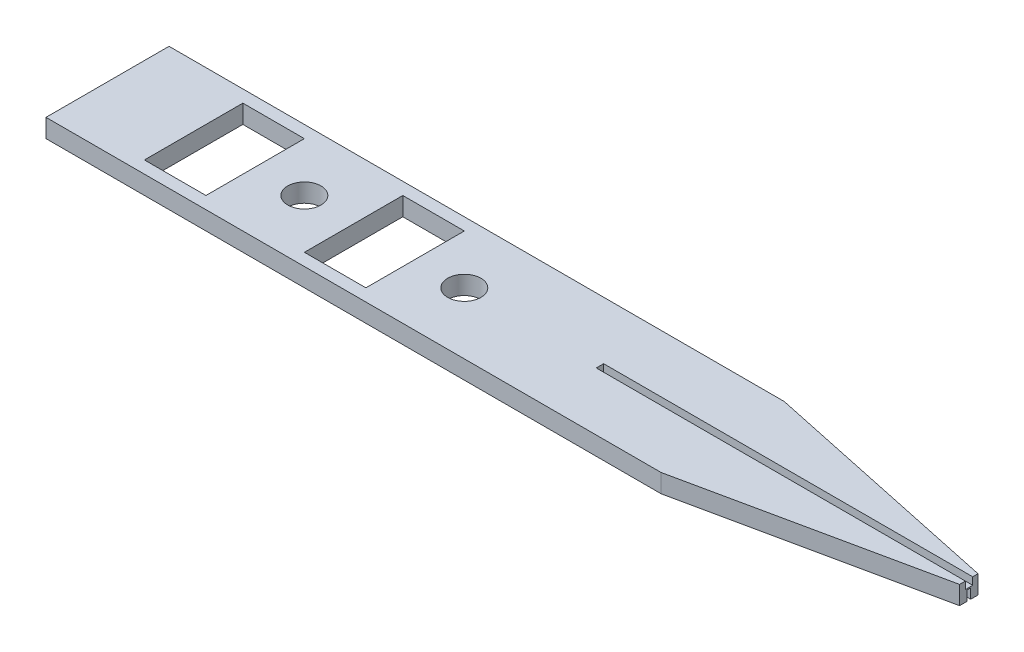
ISO-10303-21;
HEADER;
FILE_DESCRIPTION(('STEP AP214'),'2;1');
FILE_NAME('part.step','',(''),(''),'','','');
FILE_SCHEMA(('AUTOMOTIVE_DESIGN { 1 0 10303 214 1 1 1 1 }'));
ENDSEC;
DATA;
#1=APPLICATION_CONTEXT('core data for automotive mechanical design processes');
#2=APPLICATION_PROTOCOL_DEFINITION('international standard','automotive_design',2000,#1);
#3=PRODUCT_CONTEXT('',#1,'mechanical');
#4=PRODUCT('Part','Part','',(#3));
#5=PRODUCT_RELATED_PRODUCT_CATEGORY('part','',(#4));
#6=PRODUCT_DEFINITION_FORMATION('','',#4);
#7=PRODUCT_DEFINITION_CONTEXT('part definition',#1,'design');
#8=PRODUCT_DEFINITION('design','',#6,#7);
#9=PRODUCT_DEFINITION_SHAPE('','',#8);
#10=(LENGTH_UNIT() NAMED_UNIT(*) SI_UNIT(.MILLI.,.METRE.));
#11=(NAMED_UNIT(*) PLANE_ANGLE_UNIT() SI_UNIT($,.RADIAN.));
#12=(NAMED_UNIT(*) SI_UNIT($,.STERADIAN.) SOLID_ANGLE_UNIT());
#13=UNCERTAINTY_MEASURE_WITH_UNIT(LENGTH_MEASURE(1.E-05),#10,'distance_accuracy_value','');
#14=(GEOMETRIC_REPRESENTATION_CONTEXT(3) GLOBAL_UNCERTAINTY_ASSIGNED_CONTEXT((#13)) GLOBAL_UNIT_ASSIGNED_CONTEXT((#10,
#11,#12)) REPRESENTATION_CONTEXT('',''));
#15=CARTESIAN_POINT('',(0.,0.,0.));
#16=DIRECTION('',(0.,0.,1.));
#17=DIRECTION('',(1.,0.,0.));
#18=AXIS2_PLACEMENT_3D('',#15,#16,#17);
#19=CARTESIAN_POINT('',(31.3961840371878,31.452892525639,46.7205847765638));
#20=DIRECTION('',(-0.207858755820045,0.,-0.978158850917857));
#21=DIRECTION('',(-0.978158850917857,0.,0.207858755820045));
#22=AXIS2_PLACEMENT_3D('',#19,#20,#21);
#23=PLANE('',#22);
#24=DIRECTION('',(0.978158850917857,0.,-0.207858755820045));
#25=VECTOR('',#24,1.);
#26=CARTESIAN_POINT('',(31.3961840371878,29.952892525639,46.7205847765638));
#27=LINE('',#26,#25);
#28=CARTESIAN_POINT('',(31.3961840371878,29.952892525639,46.7205847765638));
#29=VERTEX_POINT('',#28);
#30=CARTESIAN_POINT('',(51.3961840371879,29.952892525639,42.4705847765638));
#31=VERTEX_POINT('',#30);
#32=EDGE_CURVE('E340',#29,#31,#27,.T.);
#33=ORIENTED_EDGE('',*,*,#32,.T.);
#34=DIRECTION('',(0.,-1.,0.));
#35=VECTOR('',#34,1.);
#36=CARTESIAN_POINT('',(51.3961840371879,31.452892525639,42.4705847765638));
#37=LINE('',#36,#35);
#38=CARTESIAN_POINT('',(51.3961840371879,31.452892525639,42.4705847765638));
#39=VERTEX_POINT('',#38);
#40=EDGE_CURVE('E41',#39,#31,#37,.T.);
#41=ORIENTED_EDGE('',*,*,#40,.F.);
#42=DIRECTION('',(0.978158850917857,0.,-0.207858755820045));
#43=VECTOR('',#42,1.);
#44=CARTESIAN_POINT('',(31.3961840371878,31.452892525639,46.7205847765638));
#45=LINE('',#44,#43);
#46=CARTESIAN_POINT('',(31.3961840371878,31.452892525639,46.7205847765638));
#47=VERTEX_POINT('',#46);
#48=EDGE_CURVE('E57',#47,#39,#45,.T.);
#49=ORIENTED_EDGE('',*,*,#48,.F.);
#50=DIRECTION('',(0.,-1.,0.));
#51=VECTOR('',#50,1.);
#52=CARTESIAN_POINT('',(31.3961840371878,31.452892525639,46.7205847765638));
#53=LINE('',#52,#51);
#54=EDGE_CURVE('E77',#47,#29,#53,.T.);
#55=ORIENTED_EDGE('',*,*,#54,.T.);
#56=EDGE_LOOP('',(#33,#41,#49,#55));
#57=FACE_BOUND('',#56,.T.);
#58=ADVANCED_FACE('F34',(#57),#23,.F.);
#59=CARTESIAN_POINT('',(51.3961840371879,31.452892525639,40.9705847765638));
#60=DIRECTION('',(-1.,0.,0.));
#61=DIRECTION('',(0.,0.,1.));
#62=AXIS2_PLACEMENT_3D('',#59,#60,#61);
#63=PLANE('',#62);
#64=DIRECTION('',(0.,0.,1.));
#65=VECTOR('',#64,1.);
#66=CARTESIAN_POINT('',(51.3961840371879,30.752892525639,41.5696120080557));
#67=LINE('',#66,#65);
#68=CARTESIAN_POINT('',(51.3961840371879,30.752892525639,41.5696120080557));
#69=VERTEX_POINT('',#68);
#70=CARTESIAN_POINT('',(51.3961840371879,30.752892525639,41.86846577619));
#71=VERTEX_POINT('',#70);
#72=EDGE_CURVE('E194',#69,#71,#67,.T.);
#73=ORIENTED_EDGE('',*,*,#72,.F.);
#74=DIRECTION('',(0.,-1.,0.));
#75=VECTOR('',#74,1.);
#76=CARTESIAN_POINT('',(51.3961840371879,30.752892525639,41.5696120080557));
#77=LINE('',#76,#75);
#78=CARTESIAN_POINT('',(51.3961840371879,29.952892525639,41.5696120080557));
#79=VERTEX_POINT('',#78);
#80=EDGE_CURVE('E224',#69,#79,#77,.T.);
#81=ORIENTED_EDGE('',*,*,#80,.T.);
#82=DIRECTION('',(0.,0.,-1.));
#83=VECTOR('',#82,1.);
#84=CARTESIAN_POINT('',(51.3961840371879,29.952892525639,40.9705847765638));
#85=LINE('',#84,#83);
#86=CARTESIAN_POINT('',(51.3961840371879,29.952892525639,40.9705847765638));
#87=VERTEX_POINT('',#86);
#88=EDGE_CURVE('E350',#79,#87,#85,.T.);
#89=ORIENTED_EDGE('',*,*,#88,.T.);
#90=DIRECTION('',(0.,-1.,0.));
#91=VECTOR('',#90,1.);
#92=CARTESIAN_POINT('',(51.3961840371879,31.452892525639,40.9705847765638));
#93=LINE('',#92,#91);
#94=CARTESIAN_POINT('',(51.3961840371879,31.452892525639,40.9705847765638));
#95=VERTEX_POINT('',#94);
#96=EDGE_CURVE('E348',#95,#87,#93,.T.);
#97=ORIENTED_EDGE('',*,*,#96,.F.);
#98=DIRECTION('',(0.,0.,-1.));
#99=VECTOR('',#98,1.);
#100=CARTESIAN_POINT('',(51.3961840371879,31.452892525639,40.9705847765638));
#101=LINE('',#100,#99);
#102=CARTESIAN_POINT('',(51.3961840371879,31.452892525639,41.3991422298061));
#103=VERTEX_POINT('',#102);
#104=EDGE_CURVE('E343',#103,#95,#101,.T.);
#105=ORIENTED_EDGE('',*,*,#104,.F.);
#106=DIRECTION('',(0.,1.,0.));
#107=VECTOR('',#106,1.);
#108=CARTESIAN_POINT('',(51.3961840371879,30.852892525639,41.3991422298061));
#109=LINE('',#108,#107);
#110=CARTESIAN_POINT('',(51.3961840371879,30.852892525639,41.3991422298061));
#111=VERTEX_POINT('',#110);
#112=EDGE_CURVE('E338',#111,#103,#109,.T.);
#113=ORIENTED_EDGE('',*,*,#112,.F.);
#114=DIRECTION('',(0.,0.,-1.));
#115=VECTOR('',#114,1.);
#116=CARTESIAN_POINT('',(51.3961840371879,30.852892525639,41.9991422298061));
#117=LINE('',#116,#115);
#118=CARTESIAN_POINT('',(51.3961840371879,30.852892525639,41.9991422298061));
#119=VERTEX_POINT('',#118);
#120=EDGE_CURVE('E332',#119,#111,#117,.T.);
#121=ORIENTED_EDGE('',*,*,#120,.F.);
#122=DIRECTION('',(0.,1.,0.));
#123=VECTOR('',#122,1.);
#124=CARTESIAN_POINT('',(51.3961840371879,30.852892525639,41.9991422298061));
#125=LINE('',#124,#123);
#126=CARTESIAN_POINT('',(51.3961840371879,31.452892525639,41.9991422298061));
#127=VERTEX_POINT('',#126);
#128=EDGE_CURVE('E336',#119,#127,#125,.T.);
#129=ORIENTED_EDGE('',*,*,#128,.T.);
#130=EDGE_CURVE('E85',#39,#127,#101,.T.);
#131=ORIENTED_EDGE('',*,*,#130,.F.);
#132=ORIENTED_EDGE('',*,*,#40,.T.);
#133=CARTESIAN_POINT('',(51.3961840371879,29.952892525639,41.86846577619));
#134=VERTEX_POINT('',#133);
#135=EDGE_CURVE('E210',#31,#134,#85,.T.);
#136=ORIENTED_EDGE('',*,*,#135,.T.);
#137=DIRECTION('',(0.,-1.,0.));
#138=VECTOR('',#137,1.);
#139=CARTESIAN_POINT('',(51.3961840371879,30.752892525639,41.86846577619));
#140=LINE('',#139,#138);
#141=EDGE_CURVE('E48',#71,#134,#140,.T.);
#142=ORIENTED_EDGE('',*,*,#141,.F.);
#143=EDGE_LOOP('',(#73,#81,#89,#97,#105,#113,#121,#129,#131,#132,#136,#142));
#144=FACE_BOUND('',#143,.T.);
#145=ADVANCED_FACE('F209',(#144),#63,.F.);
#146=CARTESIAN_POINT('',(51.3961840371879,31.452892525639,40.9705847765638));
#147=DIRECTION('',(-0.207858755820045,0.,0.978158850917857));
#148=DIRECTION('',(0.978158850917857,0.,0.207858755820045));
#149=AXIS2_PLACEMENT_3D('',#146,#147,#148);
#150=PLANE('',#149);
#151=DIRECTION('',(-0.978158850917857,0.,-0.207858755820045));
#152=VECTOR('',#151,1.);
#153=CARTESIAN_POINT('',(51.3961840371879,29.952892525639,40.9705847765638));
#154=LINE('',#153,#152);
#155=CARTESIAN_POINT('',(31.3961840371878,29.952892525639,36.7205847765638));
#156=VERTEX_POINT('',#155);
#157=EDGE_CURVE('E344',#87,#156,#154,.T.);
#158=ORIENTED_EDGE('',*,*,#157,.T.);
#159=DIRECTION('',(0.,-1.,0.));
#160=VECTOR('',#159,1.);
#161=CARTESIAN_POINT('',(31.3961840371878,31.452892525639,36.7205847765638));
#162=LINE('',#161,#160);
#163=CARTESIAN_POINT('',(31.3961840371878,31.452892525639,36.7205847765638));
#164=VERTEX_POINT('',#163);
#165=EDGE_CURVE('E298',#164,#156,#162,.T.);
#166=ORIENTED_EDGE('',*,*,#165,.F.);
#167=DIRECTION('',(-0.978158850917857,0.,-0.207858755820045));
#168=VECTOR('',#167,1.);
#169=CARTESIAN_POINT('',(51.3961840371879,31.452892525639,40.9705847765638));
#170=LINE('',#169,#168);
#171=EDGE_CURVE('E346',#95,#164,#170,.T.);
#172=ORIENTED_EDGE('',*,*,#171,.F.);
#173=ORIENTED_EDGE('',*,*,#96,.T.);
#174=EDGE_LOOP('',(#158,#166,#172,#173));
#175=FACE_BOUND('',#174,.T.);
#176=ADVANCED_FACE('F377',(#175),#150,.F.);
#177=CARTESIAN_POINT('',(31.3961840371878,31.452892525639,41.7205847765638));
#178=DIRECTION('',(0.,-1.,0.));
#179=DIRECTION('',(0.,0.,-1.));
#180=AXIS2_PLACEMENT_3D('',#177,#178,#179);
#181=PLANE('',#180);
#182=ORIENTED_EDGE('',*,*,#130,.T.);
#183=DIRECTION('',(-1.,0.,0.));
#184=VECTOR('',#183,1.);
#185=CARTESIAN_POINT('',(31.3961840371878,31.452892525639,41.9991422298061));
#186=LINE('',#185,#184);
#187=CARTESIAN_POINT('',(21.3961840371878,31.452892525639,41.9991422298061));
#188=VERTEX_POINT('',#187);
#189=EDGE_CURVE('E11',#127,#188,#186,.T.);
#190=ORIENTED_EDGE('',*,*,#189,.T.);
#191=DIRECTION('',(0.,0.,1.));
#192=VECTOR('',#191,1.);
#193=CARTESIAN_POINT('',(21.3961840371878,31.452892525639,41.3991422298061));
#194=LINE('',#193,#192);
#195=CARTESIAN_POINT('',(21.3961840371878,31.452892525639,41.3991422298061));
#196=VERTEX_POINT('',#195);
#197=EDGE_CURVE('E221',#196,#188,#194,.T.);
#198=ORIENTED_EDGE('',*,*,#197,.F.);
#199=DIRECTION('',(-1.,0.,0.));
#200=VECTOR('',#199,1.);
#201=CARTESIAN_POINT('',(51.3961840371879,31.452892525639,41.3991422298061));
#202=LINE('',#201,#200);
#203=EDGE_CURVE('E327',#103,#196,#202,.T.);
#204=ORIENTED_EDGE('',*,*,#203,.F.);
#205=ORIENTED_EDGE('',*,*,#104,.T.);
#206=ORIENTED_EDGE('',*,*,#171,.T.);
#207=DIRECTION('',(-1.,0.,0.));
#208=VECTOR('',#207,1.);
#209=CARTESIAN_POINT('',(-18.6038159628122,31.452892525639,36.7205847765638));
#210=LINE('',#209,#208);
#211=CARTESIAN_POINT('',(-18.6038159628122,31.452892525639,36.7205847765638));
#212=VERTEX_POINT('',#211);
#213=EDGE_CURVE('E279',#164,#212,#210,.T.);
#214=ORIENTED_EDGE('',*,*,#213,.T.);
#215=DIRECTION('',(0.,0.,1.));
#216=VECTOR('',#215,1.);
#217=CARTESIAN_POINT('',(-18.6038159628122,31.452892525639,36.7205847765638));
#218=LINE('',#217,#216);
#219=CARTESIAN_POINT('',(-18.6038159628122,31.452892525639,46.7205847765638));
#220=VERTEX_POINT('',#219);
#221=EDGE_CURVE('E281',#212,#220,#218,.T.);
#222=ORIENTED_EDGE('',*,*,#221,.T.);
#223=DIRECTION('',(1.,0.,0.));
#224=VECTOR('',#223,1.);
#225=CARTESIAN_POINT('',(-18.6038159628122,31.452892525639,46.7205847765638));
#226=LINE('',#225,#224);
#227=EDGE_CURVE('E284',#220,#47,#226,.T.);
#228=ORIENTED_EDGE('',*,*,#227,.T.);
#229=ORIENTED_EDGE('',*,*,#48,.T.);
#230=EDGE_LOOP('',(#182,#190,#198,#204,#205,#206,#214,#222,#228,#229));
#231=FACE_BOUND('',#230,.T.);
#232=CARTESIAN_POINT('',(10.3961840371879,31.452892525639,41.7205847765638));
#233=DIRECTION('',(0.,1.,0.));
#234=DIRECTION('',(0.,0.,1.));
#235=AXIS2_PLACEMENT_3D('',#232,#233,#234);
#236=CIRCLE('',#235,1.35);
#237=CARTESIAN_POINT('',(10.3961840371879,31.452892525639,43.0705847765638));
#238=VERTEX_POINT('',#237);
#239=EDGE_CURVE('E228',#238,#238,#236,.T.);
#240=ORIENTED_EDGE('',*,*,#239,.F.);
#241=EDGE_LOOP('',(#240));
#242=FACE_BOUND('',#241,.T.);
#243=DIRECTION('',(1.,0.,0.));
#244=VECTOR('',#243,1.);
#245=CARTESIAN_POINT('',(1.39618403718784,31.452892525639,45.7205847765638));
#246=LINE('',#245,#244);
#247=CARTESIAN_POINT('',(1.39618403718784,31.452892525639,45.7205847765638));
#248=VERTEX_POINT('',#247);
#249=CARTESIAN_POINT('',(6.39618403718784,31.452892525639,45.7205847765638));
#250=VERTEX_POINT('',#249);
#251=EDGE_CURVE('E234',#248,#250,#246,.T.);
#252=ORIENTED_EDGE('',*,*,#251,.F.);
#253=DIRECTION('',(0.,0.,1.));
#254=VECTOR('',#253,1.);
#255=CARTESIAN_POINT('',(1.39618403718784,31.452892525639,37.7205847765638));
#256=LINE('',#255,#254);
#257=CARTESIAN_POINT('',(1.39618403718784,31.452892525639,37.7205847765638));
#258=VERTEX_POINT('',#257);
#259=EDGE_CURVE('E242',#258,#248,#256,.T.);
#260=ORIENTED_EDGE('',*,*,#259,.F.);
#261=DIRECTION('',(-1.,0.,0.));
#262=VECTOR('',#261,1.);
#263=CARTESIAN_POINT('',(1.39618403718784,31.452892525639,37.7205847765638));
#264=LINE('',#263,#262);
#265=CARTESIAN_POINT('',(6.39618403718784,31.452892525639,37.7205847765638));
#266=VERTEX_POINT('',#265);
#267=EDGE_CURVE('E239',#266,#258,#264,.T.);
#268=ORIENTED_EDGE('',*,*,#267,.F.);
#269=DIRECTION('',(0.,0.,-1.));
#270=VECTOR('',#269,1.);
#271=CARTESIAN_POINT('',(6.39618403718784,31.452892525639,45.7205847765638));
#272=LINE('',#271,#270);
#273=EDGE_CURVE('E236',#250,#266,#272,.T.);
#274=ORIENTED_EDGE('',*,*,#273,.F.);
#275=EDGE_LOOP('',(#252,#260,#268,#274));
#276=FACE_BOUND('',#275,.T.);
#277=CARTESIAN_POINT('',(-2.60381596281216,31.452892525639,41.7205847765638));
#278=DIRECTION('',(0.,1.,0.));
#279=DIRECTION('',(0.,0.,1.));
#280=AXIS2_PLACEMENT_3D('',#277,#278,#279);
#281=CIRCLE('',#280,1.35);
#282=CARTESIAN_POINT('',(-2.60381596281216,31.452892525639,43.0705847765638));
#283=VERTEX_POINT('',#282);
#284=EDGE_CURVE('E248',#283,#283,#281,.T.);
#285=ORIENTED_EDGE('',*,*,#284,.F.);
#286=EDGE_LOOP('',(#285));
#287=FACE_BOUND('',#286,.T.);
#288=DIRECTION('',(1.,0.,0.));
#289=VECTOR('',#288,1.);
#290=CARTESIAN_POINT('',(-11.6038159628122,31.452892525639,45.7205847765638));
#291=LINE('',#290,#289);
#292=CARTESIAN_POINT('',(-11.6038159628122,31.452892525639,45.7205847765638));
#293=VERTEX_POINT('',#292);
#294=CARTESIAN_POINT('',(-6.60381596281216,31.452892525639,45.7205847765638));
#295=VERTEX_POINT('',#294);
#296=EDGE_CURVE('E258',#293,#295,#291,.T.);
#297=ORIENTED_EDGE('',*,*,#296,.F.);
#298=DIRECTION('',(0.,0.,1.));
#299=VECTOR('',#298,1.);
#300=CARTESIAN_POINT('',(-11.6038159628122,31.452892525639,37.7205847765638));
#301=LINE('',#300,#299);
#302=CARTESIAN_POINT('',(-11.6038159628122,31.452892525639,37.7205847765638));
#303=VERTEX_POINT('',#302);
#304=EDGE_CURVE('E266',#303,#293,#301,.T.);
#305=ORIENTED_EDGE('',*,*,#304,.F.);
#306=DIRECTION('',(-1.,0.,0.));
#307=VECTOR('',#306,1.);
#308=CARTESIAN_POINT('',(-11.6038159628122,31.452892525639,37.7205847765638));
#309=LINE('',#308,#307);
#310=CARTESIAN_POINT('',(-6.60381596281216,31.452892525639,37.7205847765638));
#311=VERTEX_POINT('',#310);
#312=EDGE_CURVE('E263',#311,#303,#309,.T.);
#313=ORIENTED_EDGE('',*,*,#312,.F.);
#314=DIRECTION('',(0.,0.,-1.));
#315=VECTOR('',#314,1.);
#316=CARTESIAN_POINT('',(-6.60381596281216,31.452892525639,45.7205847765638));
#317=LINE('',#316,#315);
#318=EDGE_CURVE('E260',#295,#311,#317,.T.);
#319=ORIENTED_EDGE('',*,*,#318,.F.);
#320=EDGE_LOOP('',(#297,#305,#313,#319));
#321=FACE_BOUND('',#320,.T.);
#322=ADVANCED_FACE('F411',(#231,#242,#276,#287,#321),#181,.F.);
#323=CARTESIAN_POINT('',(31.3961840371878,29.952892525639,41.7205847765638));
#324=DIRECTION('',(0.,-1.,0.));
#325=DIRECTION('',(0.,0.,-1.));
#326=AXIS2_PLACEMENT_3D('',#323,#324,#325);
#327=PLANE('',#326);
#328=DIRECTION('',(1.,0.,0.));
#329=VECTOR('',#328,1.);
#330=CARTESIAN_POINT('',(21.4001657899855,29.952892525639,41.5696120080557));
#331=LINE('',#330,#329);
#332=CARTESIAN_POINT('',(21.4001657899855,29.952892525639,41.5696120080557));
#333=VERTEX_POINT('',#332);
#334=EDGE_CURVE('E201',#333,#79,#331,.T.);
#335=ORIENTED_EDGE('',*,*,#334,.F.);
#336=DIRECTION('',(0.,0.,-1.));
#337=VECTOR('',#336,1.);
#338=CARTESIAN_POINT('',(21.4001657899855,29.952892525639,41.86846577619));
#339=LINE('',#338,#337);
#340=CARTESIAN_POINT('',(21.4001657899855,29.952892525639,41.86846577619));
#341=VERTEX_POINT('',#340);
#342=EDGE_CURVE('E383',#341,#333,#339,.T.);
#343=ORIENTED_EDGE('',*,*,#342,.F.);
#344=DIRECTION('',(-1.,0.,0.));
#345=VECTOR('',#344,1.);
#346=CARTESIAN_POINT('',(51.3961840371879,29.952892525639,41.86846577619));
#347=LINE('',#346,#345);
#348=EDGE_CURVE('E386',#134,#341,#347,.T.);
#349=ORIENTED_EDGE('',*,*,#348,.F.);
#350=ORIENTED_EDGE('',*,*,#135,.F.);
#351=ORIENTED_EDGE('',*,*,#32,.F.);
#352=DIRECTION('',(1.,0.,0.));
#353=VECTOR('',#352,1.);
#354=CARTESIAN_POINT('',(-18.6038159628122,29.952892525639,46.7205847765638));
#355=LINE('',#354,#353);
#356=CARTESIAN_POINT('',(-18.6038159628122,29.952892525639,46.7205847765638));
#357=VERTEX_POINT('',#356);
#358=EDGE_CURVE('E282',#357,#29,#355,.T.);
#359=ORIENTED_EDGE('',*,*,#358,.F.);
#360=DIRECTION('',(0.,0.,1.));
#361=VECTOR('',#360,1.);
#362=CARTESIAN_POINT('',(-18.6038159628122,29.952892525639,36.7205847765638));
#363=LINE('',#362,#361);
#364=CARTESIAN_POINT('',(-18.6038159628122,29.952892525639,36.7205847765638));
#365=VERTEX_POINT('',#364);
#366=EDGE_CURVE('E287',#365,#357,#363,.T.);
#367=ORIENTED_EDGE('',*,*,#366,.F.);
#368=DIRECTION('',(-1.,0.,0.));
#369=VECTOR('',#368,1.);
#370=CARTESIAN_POINT('',(-18.6038159628122,29.952892525639,36.7205847765638));
#371=LINE('',#370,#369);
#372=EDGE_CURVE('E272',#156,#365,#371,.T.);
#373=ORIENTED_EDGE('',*,*,#372,.F.);
#374=ORIENTED_EDGE('',*,*,#157,.F.);
#375=ORIENTED_EDGE('',*,*,#88,.F.);
#376=EDGE_LOOP('',(#335,#343,#349,#350,#351,#359,#367,#373,#374,#375));
#377=FACE_BOUND('',#376,.T.);
#378=CARTESIAN_POINT('',(10.3961840371879,29.952892525639,41.7205847765638));
#379=DIRECTION('',(0.,1.,0.));
#380=DIRECTION('',(0.,0.,1.));
#381=AXIS2_PLACEMENT_3D('',#378,#379,#380);
#382=CIRCLE('',#381,1.35);
#383=CARTESIAN_POINT('',(10.3961840371879,29.952892525639,43.0705847765638));
#384=VERTEX_POINT('',#383);
#385=EDGE_CURVE('E233',#384,#384,#382,.T.);
#386=ORIENTED_EDGE('',*,*,#385,.T.);
#387=EDGE_LOOP('',(#386));
#388=FACE_BOUND('',#387,.T.);
#389=DIRECTION('',(0.,0.,1.));
#390=VECTOR('',#389,1.);
#391=CARTESIAN_POINT('',(1.39618403718784,29.952892525639,41.7205847765638));
#392=LINE('',#391,#390);
#393=CARTESIAN_POINT('',(1.39618403718784,29.952892525639,37.7205847765638));
#394=VERTEX_POINT('',#393);
#395=CARTESIAN_POINT('',(1.39618403718784,29.952892525639,45.7205847765638));
#396=VERTEX_POINT('',#395);
#397=EDGE_CURVE('E321',#394,#396,#392,.T.);
#398=ORIENTED_EDGE('',*,*,#397,.T.);
#399=DIRECTION('',(1.,0.,0.));
#400=VECTOR('',#399,1.);
#401=CARTESIAN_POINT('',(6.39618403718786,29.952892525639,45.7205847765638));
#402=LINE('',#401,#400);
#403=CARTESIAN_POINT('',(6.39618403718784,29.952892525639,45.7205847765638));
#404=VERTEX_POINT('',#403);
#405=EDGE_CURVE('E324',#396,#404,#402,.T.);
#406=ORIENTED_EDGE('',*,*,#405,.T.);
#407=DIRECTION('',(0.,0.,-1.));
#408=VECTOR('',#407,1.);
#409=CARTESIAN_POINT('',(6.39618403718784,29.952892525639,41.7205847765638));
#410=LINE('',#409,#408);
#411=CARTESIAN_POINT('',(6.39618403718784,29.952892525639,37.7205847765638));
#412=VERTEX_POINT('',#411);
#413=EDGE_CURVE('E313',#404,#412,#410,.T.);
#414=ORIENTED_EDGE('',*,*,#413,.T.);
#415=DIRECTION('',(-1.,0.,0.));
#416=VECTOR('',#415,1.);
#417=CARTESIAN_POINT('',(6.39618403718786,29.952892525639,37.7205847765638));
#418=LINE('',#417,#416);
#419=EDGE_CURVE('E318',#412,#394,#418,.T.);
#420=ORIENTED_EDGE('',*,*,#419,.T.);
#421=EDGE_LOOP('',(#398,#406,#414,#420));
#422=FACE_BOUND('',#421,.T.);
#423=CARTESIAN_POINT('',(-2.60381596281216,29.952892525639,41.7205847765638));
#424=DIRECTION('',(0.,1.,0.));
#425=DIRECTION('',(0.,0.,1.));
#426=AXIS2_PLACEMENT_3D('',#423,#424,#425);
#427=CIRCLE('',#426,1.35);
#428=CARTESIAN_POINT('',(-2.60381596281216,29.952892525639,43.0705847765638));
#429=VERTEX_POINT('',#428);
#430=EDGE_CURVE('E257',#429,#429,#427,.T.);
#431=ORIENTED_EDGE('',*,*,#430,.T.);
#432=EDGE_LOOP('',(#431));
#433=FACE_BOUND('',#432,.T.);
#434=DIRECTION('',(0.,0.,1.));
#435=VECTOR('',#434,1.);
#436=CARTESIAN_POINT('',(-11.6038159628122,29.952892525639,41.7205847765638));
#437=LINE('',#436,#435);
#438=CARTESIAN_POINT('',(-11.6038159628122,29.952892525639,37.7205847765638));
#439=VERTEX_POINT('',#438);
#440=CARTESIAN_POINT('',(-11.6038159628122,29.952892525639,45.7205847765638));
#441=VERTEX_POINT('',#440);
#442=EDGE_CURVE('E307',#439,#441,#437,.T.);
#443=ORIENTED_EDGE('',*,*,#442,.T.);
#444=DIRECTION('',(1.,0.,0.));
#445=VECTOR('',#444,1.);
#446=CARTESIAN_POINT('',(6.39618403718786,29.952892525639,45.7205847765638));
#447=LINE('',#446,#445);
#448=CARTESIAN_POINT('',(-6.60381596281216,29.952892525639,45.7205847765638));
#449=VERTEX_POINT('',#448);
#450=EDGE_CURVE('E310',#441,#449,#447,.T.);
#451=ORIENTED_EDGE('',*,*,#450,.T.);
#452=DIRECTION('',(0.,0.,-1.));
#453=VECTOR('',#452,1.);
#454=CARTESIAN_POINT('',(-6.60381596281216,29.952892525639,41.7205847765638));
#455=LINE('',#454,#453);
#456=CARTESIAN_POINT('',(-6.60381596281216,29.952892525639,37.7205847765638));
#457=VERTEX_POINT('',#456);
#458=EDGE_CURVE('E301',#449,#457,#455,.T.);
#459=ORIENTED_EDGE('',*,*,#458,.T.);
#460=DIRECTION('',(-1.,0.,0.));
#461=VECTOR('',#460,1.);
#462=CARTESIAN_POINT('',(6.39618403718786,29.952892525639,37.7205847765638));
#463=LINE('',#462,#461);
#464=EDGE_CURVE('E304',#457,#439,#463,.T.);
#465=ORIENTED_EDGE('',*,*,#464,.T.);
#466=EDGE_LOOP('',(#443,#451,#459,#465));
#467=FACE_BOUND('',#466,.T.);
#468=ADVANCED_FACE('F357',(#377,#388,#422,#433,#467),#327,.T.);
#469=CARTESIAN_POINT('',(0.,30.852892525639,0.));
#470=DIRECTION('',(0.,-1.,0.));
#471=DIRECTION('',(0.,0.,-1.));
#472=AXIS2_PLACEMENT_3D('',#469,#470,#471);
#473=PLANE('',#472);
#474=DIRECTION('',(1.,0.,0.));
#475=VECTOR('',#474,1.);
#476=CARTESIAN_POINT('',(51.3961840371879,30.852892525639,41.9991422298061));
#477=LINE('',#476,#475);
#478=CARTESIAN_POINT('',(21.3961840371878,30.852892525639,41.9991422298061));
#479=VERTEX_POINT('',#478);
#480=EDGE_CURVE('E330',#479,#119,#477,.T.);
#481=ORIENTED_EDGE('',*,*,#480,.T.);
#482=ORIENTED_EDGE('',*,*,#120,.T.);
#483=DIRECTION('',(-1.,0.,0.));
#484=VECTOR('',#483,1.);
#485=CARTESIAN_POINT('',(51.3961840371879,30.852892525639,41.3991422298061));
#486=LINE('',#485,#484);
#487=CARTESIAN_POINT('',(21.3961840371878,30.852892525639,41.3991422298061));
#488=VERTEX_POINT('',#487);
#489=EDGE_CURVE('E334',#111,#488,#486,.T.);
#490=ORIENTED_EDGE('',*,*,#489,.T.);
#491=DIRECTION('',(0.,0.,1.));
#492=VECTOR('',#491,1.);
#493=CARTESIAN_POINT('',(21.3961840371878,30.852892525639,41.3991422298061));
#494=LINE('',#493,#492);
#495=EDGE_CURVE('E217',#488,#479,#494,.T.);
#496=ORIENTED_EDGE('',*,*,#495,.T.);
#497=EDGE_LOOP('',(#481,#482,#490,#496));
#498=FACE_BOUND('',#497,.T.);
#499=ADVANCED_FACE('F415',(#498),#473,.F.);
#500=CARTESIAN_POINT('',(51.3961840371879,30.852892525639,41.3991422298061));
#501=DIRECTION('',(0.,0.,-1.));
#502=DIRECTION('',(-1.,0.,0.));
#503=AXIS2_PLACEMENT_3D('',#500,#501,#502);
#504=PLANE('',#503);
#505=ORIENTED_EDGE('',*,*,#489,.F.);
#506=ORIENTED_EDGE('',*,*,#112,.T.);
#507=ORIENTED_EDGE('',*,*,#203,.T.);
#508=DIRECTION('',(0.,1.,0.));
#509=VECTOR('',#508,1.);
#510=CARTESIAN_POINT('',(21.3961840371878,30.852892525639,41.3991422298061));
#511=LINE('',#510,#509);
#512=EDGE_CURVE('E225',#488,#196,#511,.T.);
#513=ORIENTED_EDGE('',*,*,#512,.F.);
#514=EDGE_LOOP('',(#505,#506,#507,#513));
#515=FACE_BOUND('',#514,.T.);
#516=ADVANCED_FACE('F422',(#515),#504,.F.);
#517=CARTESIAN_POINT('',(51.3961840371879,30.852892525639,41.9991422298061));
#518=DIRECTION('',(0.,0.,1.));
#519=DIRECTION('',(1.,0.,0.));
#520=AXIS2_PLACEMENT_3D('',#517,#518,#519);
#521=PLANE('',#520);
#522=ORIENTED_EDGE('',*,*,#189,.F.);
#523=ORIENTED_EDGE('',*,*,#128,.F.);
#524=ORIENTED_EDGE('',*,*,#480,.F.);
#525=DIRECTION('',(0.,1.,0.));
#526=VECTOR('',#525,1.);
#527=CARTESIAN_POINT('',(21.3961840371878,30.852892525639,41.9991422298061));
#528=LINE('',#527,#526);
#529=EDGE_CURVE('E220',#479,#188,#528,.T.);
#530=ORIENTED_EDGE('',*,*,#529,.T.);
#531=EDGE_LOOP('',(#522,#523,#524,#530));
#532=FACE_BOUND('',#531,.T.);
#533=ADVANCED_FACE('F419',(#532),#521,.F.);
#534=CARTESIAN_POINT('',(-18.6038159628122,31.452892525639,36.7205847765638));
#535=DIRECTION('',(0.,0.,1.));
#536=DIRECTION('',(1.,0.,0.));
#537=AXIS2_PLACEMENT_3D('',#534,#535,#536);
#538=PLANE('',#537);
#539=ORIENTED_EDGE('',*,*,#372,.T.);
#540=DIRECTION('',(0.,-1.,0.));
#541=VECTOR('',#540,1.);
#542=CARTESIAN_POINT('',(-18.6038159628122,31.452892525639,36.7205847765638));
#543=LINE('',#542,#541);
#544=EDGE_CURVE('E295',#212,#365,#543,.T.);
#545=ORIENTED_EDGE('',*,*,#544,.F.);
#546=ORIENTED_EDGE('',*,*,#213,.F.);
#547=ORIENTED_EDGE('',*,*,#165,.T.);
#548=EDGE_LOOP('',(#539,#545,#546,#547));
#549=FACE_BOUND('',#548,.T.);
#550=ADVANCED_FACE('F374',(#549),#538,.F.);
#551=CARTESIAN_POINT('',(-18.6038159628122,31.452892525639,36.7205847765638));
#552=DIRECTION('',(1.,0.,0.));
#553=DIRECTION('',(0.,0.,-1.));
#554=AXIS2_PLACEMENT_3D('',#551,#552,#553);
#555=PLANE('',#554);
#556=ORIENTED_EDGE('',*,*,#366,.T.);
#557=DIRECTION('',(0.,-1.,0.));
#558=VECTOR('',#557,1.);
#559=CARTESIAN_POINT('',(-18.6038159628122,31.452892525639,46.7205847765638));
#560=LINE('',#559,#558);
#561=EDGE_CURVE('E292',#220,#357,#560,.T.);
#562=ORIENTED_EDGE('',*,*,#561,.F.);
#563=ORIENTED_EDGE('',*,*,#221,.F.);
#564=ORIENTED_EDGE('',*,*,#544,.T.);
#565=EDGE_LOOP('',(#556,#562,#563,#564));
#566=FACE_BOUND('',#565,.T.);
#567=ADVANCED_FACE('F366',(#566),#555,.F.);
#568=CARTESIAN_POINT('',(-18.6038159628122,31.452892525639,46.7205847765638));
#569=DIRECTION('',(0.,0.,-1.));
#570=DIRECTION('',(-1.,0.,0.));
#571=AXIS2_PLACEMENT_3D('',#568,#569,#570);
#572=PLANE('',#571);
#573=ORIENTED_EDGE('',*,*,#358,.T.);
#574=ORIENTED_EDGE('',*,*,#54,.F.);
#575=ORIENTED_EDGE('',*,*,#227,.F.);
#576=ORIENTED_EDGE('',*,*,#561,.T.);
#577=EDGE_LOOP('',(#573,#574,#575,#576));
#578=FACE_BOUND('',#577,.T.);
#579=ADVANCED_FACE('F361',(#578),#572,.F.);
#580=CARTESIAN_POINT('',(-11.6038159628122,29.452892525639,45.7205847765638));
#581=DIRECTION('',(0.,0.,1.));
#582=DIRECTION('',(1.,0.,0.));
#583=AXIS2_PLACEMENT_3D('',#580,#581,#582);
#584=PLANE('',#583);
#585=DIRECTION('',(0.,1.,0.));
#586=VECTOR('',#585,1.);
#587=CARTESIAN_POINT('',(-11.6038159628122,29.452892525639,45.7205847765638));
#588=LINE('',#587,#586);
#589=EDGE_CURVE('E270',#441,#293,#588,.T.);
#590=ORIENTED_EDGE('',*,*,#589,.T.);
#591=ORIENTED_EDGE('',*,*,#296,.T.);
#592=DIRECTION('',(0.,1.,0.));
#593=VECTOR('',#592,1.);
#594=CARTESIAN_POINT('',(-6.60381596281216,29.452892525639,45.7205847765638));
#595=LINE('',#594,#593);
#596=EDGE_CURVE('E269',#449,#295,#595,.T.);
#597=ORIENTED_EDGE('',*,*,#596,.F.);
#598=ORIENTED_EDGE('',*,*,#450,.F.);
#599=EDGE_LOOP('',(#590,#591,#597,#598));
#600=FACE_BOUND('',#599,.T.);
#601=ADVANCED_FACE('F436',(#600),#584,.F.);
#602=CARTESIAN_POINT('',(-11.6038159628122,29.452892525639,37.7205847765638));
#603=DIRECTION('',(-1.,0.,0.));
#604=DIRECTION('',(0.,0.,1.));
#605=AXIS2_PLACEMENT_3D('',#602,#603,#604);
#606=PLANE('',#605);
#607=DIRECTION('',(0.,1.,0.));
#608=VECTOR('',#607,1.);
#609=CARTESIAN_POINT('',(-11.6038159628122,29.452892525639,37.7205847765638));
#610=LINE('',#609,#608);
#611=EDGE_CURVE('E273',#439,#303,#610,.T.);
#612=ORIENTED_EDGE('',*,*,#611,.T.);
#613=ORIENTED_EDGE('',*,*,#304,.T.);
#614=ORIENTED_EDGE('',*,*,#589,.F.);
#615=ORIENTED_EDGE('',*,*,#442,.F.);
#616=EDGE_LOOP('',(#612,#613,#614,#615));
#617=FACE_BOUND('',#616,.T.);
#618=ADVANCED_FACE('F439',(#617),#606,.F.);
#619=CARTESIAN_POINT('',(-11.6038159628122,29.452892525639,37.7205847765638));
#620=DIRECTION('',(0.,0.,-1.));
#621=DIRECTION('',(-1.,0.,0.));
#622=AXIS2_PLACEMENT_3D('',#619,#620,#621);
#623=PLANE('',#622);
#624=DIRECTION('',(0.,1.,0.));
#625=VECTOR('',#624,1.);
#626=CARTESIAN_POINT('',(-6.60381596281216,29.452892525639,37.7205847765638));
#627=LINE('',#626,#625);
#628=EDGE_CURVE('E275',#457,#311,#627,.T.);
#629=ORIENTED_EDGE('',*,*,#628,.T.);
#630=ORIENTED_EDGE('',*,*,#312,.T.);
#631=ORIENTED_EDGE('',*,*,#611,.F.);
#632=ORIENTED_EDGE('',*,*,#464,.F.);
#633=EDGE_LOOP('',(#629,#630,#631,#632));
#634=FACE_BOUND('',#633,.T.);
#635=ADVANCED_FACE('F445',(#634),#623,.F.);
#636=CARTESIAN_POINT('',(-6.60381596281216,29.452892525639,45.7205847765638));
#637=DIRECTION('',(1.,0.,0.));
#638=DIRECTION('',(0.,0.,-1.));
#639=AXIS2_PLACEMENT_3D('',#636,#637,#638);
#640=PLANE('',#639);
#641=ORIENTED_EDGE('',*,*,#596,.T.);
#642=ORIENTED_EDGE('',*,*,#318,.T.);
#643=ORIENTED_EDGE('',*,*,#628,.F.);
#644=ORIENTED_EDGE('',*,*,#458,.F.);
#645=EDGE_LOOP('',(#641,#642,#643,#644));
#646=FACE_BOUND('',#645,.T.);
#647=ADVANCED_FACE('F441',(#646),#640,.F.);
#648=CARTESIAN_POINT('',(-2.60381596281216,29.452892525639,41.7205847765638));
#649=DIRECTION('',(0.,1.,0.));
#650=DIRECTION('',(0.,0.,1.));
#651=AXIS2_PLACEMENT_3D('',#648,#649,#650);
#652=CYLINDRICAL_SURFACE('',#651,1.35);
#653=ORIENTED_EDGE('',*,*,#284,.T.);
#654=EDGE_LOOP('',(#653));
#655=FACE_BOUND('',#654,.T.);
#656=ORIENTED_EDGE('',*,*,#430,.F.);
#657=EDGE_LOOP('',(#656));
#658=FACE_BOUND('',#657,.T.);
#659=ADVANCED_FACE('F444',(#655,#658),#652,.F.);
#660=CARTESIAN_POINT('',(1.39618403718784,29.452892525639,45.7205847765638));
#661=DIRECTION('',(0.,0.,1.));
#662=DIRECTION('',(1.,0.,0.));
#663=AXIS2_PLACEMENT_3D('',#660,#661,#662);
#664=PLANE('',#663);
#665=DIRECTION('',(0.,1.,0.));
#666=VECTOR('',#665,1.);
#667=CARTESIAN_POINT('',(1.39618403718784,29.452892525639,45.7205847765638));
#668=LINE('',#667,#666);
#669=EDGE_CURVE('E246',#396,#248,#668,.T.);
#670=ORIENTED_EDGE('',*,*,#669,.T.);
#671=ORIENTED_EDGE('',*,*,#251,.T.);
#672=DIRECTION('',(0.,1.,0.));
#673=VECTOR('',#672,1.);
#674=CARTESIAN_POINT('',(6.39618403718784,29.452892525639,45.7205847765638));
#675=LINE('',#674,#673);
#676=EDGE_CURVE('E245',#404,#250,#675,.T.);
#677=ORIENTED_EDGE('',*,*,#676,.F.);
#678=ORIENTED_EDGE('',*,*,#405,.F.);
#679=EDGE_LOOP('',(#670,#671,#677,#678));
#680=FACE_BOUND('',#679,.T.);
#681=ADVANCED_FACE('F455',(#680),#664,.F.);
#682=CARTESIAN_POINT('',(1.39618403718784,29.452892525639,37.7205847765638));
#683=DIRECTION('',(-1.,0.,0.));
#684=DIRECTION('',(0.,0.,1.));
#685=AXIS2_PLACEMENT_3D('',#682,#683,#684);
#686=PLANE('',#685);
#687=DIRECTION('',(0.,1.,0.));
#688=VECTOR('',#687,1.);
#689=CARTESIAN_POINT('',(1.39618403718784,29.452892525639,37.7205847765638));
#690=LINE('',#689,#688);
#691=EDGE_CURVE('E249',#394,#258,#690,.T.);
#692=ORIENTED_EDGE('',*,*,#691,.T.);
#693=ORIENTED_EDGE('',*,*,#259,.T.);
#694=ORIENTED_EDGE('',*,*,#669,.F.);
#695=ORIENTED_EDGE('',*,*,#397,.F.);
#696=EDGE_LOOP('',(#692,#693,#694,#695));
#697=FACE_BOUND('',#696,.T.);
#698=ADVANCED_FACE('F459',(#697),#686,.F.);
#699=CARTESIAN_POINT('',(1.39618403718784,29.452892525639,37.7205847765638));
#700=DIRECTION('',(0.,0.,-1.));
#701=DIRECTION('',(-1.,0.,0.));
#702=AXIS2_PLACEMENT_3D('',#699,#700,#701);
#703=PLANE('',#702);
#704=DIRECTION('',(0.,1.,0.));
#705=VECTOR('',#704,1.);
#706=CARTESIAN_POINT('',(6.39618403718784,29.452892525639,37.7205847765638));
#707=LINE('',#706,#705);
#708=EDGE_CURVE('E251',#412,#266,#707,.T.);
#709=ORIENTED_EDGE('',*,*,#708,.T.);
#710=ORIENTED_EDGE('',*,*,#267,.T.);
#711=ORIENTED_EDGE('',*,*,#691,.F.);
#712=ORIENTED_EDGE('',*,*,#419,.F.);
#713=EDGE_LOOP('',(#709,#710,#711,#712));
#714=FACE_BOUND('',#713,.T.);
#715=ADVANCED_FACE('F465',(#714),#703,.F.);
#716=CARTESIAN_POINT('',(6.39618403718784,29.452892525639,45.7205847765638));
#717=DIRECTION('',(1.,0.,0.));
#718=DIRECTION('',(0.,0.,-1.));
#719=AXIS2_PLACEMENT_3D('',#716,#717,#718);
#720=PLANE('',#719);
#721=ORIENTED_EDGE('',*,*,#676,.T.);
#722=ORIENTED_EDGE('',*,*,#273,.T.);
#723=ORIENTED_EDGE('',*,*,#708,.F.);
#724=ORIENTED_EDGE('',*,*,#413,.F.);
#725=EDGE_LOOP('',(#721,#722,#723,#724));
#726=FACE_BOUND('',#725,.T.);
#727=ADVANCED_FACE('F461',(#726),#720,.F.);
#728=CARTESIAN_POINT('',(10.3961840371879,29.452892525639,41.7205847765638));
#729=DIRECTION('',(0.,1.,0.));
#730=DIRECTION('',(0.,0.,1.));
#731=AXIS2_PLACEMENT_3D('',#728,#729,#730);
#732=CYLINDRICAL_SURFACE('',#731,1.35);
#733=ORIENTED_EDGE('',*,*,#239,.T.);
#734=EDGE_LOOP('',(#733));
#735=FACE_BOUND('',#734,.T.);
#736=ORIENTED_EDGE('',*,*,#385,.F.);
#737=EDGE_LOOP('',(#736));
#738=FACE_BOUND('',#737,.T.);
#739=ADVANCED_FACE('F464',(#735,#738),#732,.F.);
#740=CARTESIAN_POINT('',(21.3961840371878,30.852892525639,41.3991422298061));
#741=DIRECTION('',(-1.,0.,0.));
#742=DIRECTION('',(0.,0.,1.));
#743=AXIS2_PLACEMENT_3D('',#740,#741,#742);
#744=PLANE('',#743);
#745=ORIENTED_EDGE('',*,*,#197,.T.);
#746=ORIENTED_EDGE('',*,*,#529,.F.);
#747=ORIENTED_EDGE('',*,*,#495,.F.);
#748=ORIENTED_EDGE('',*,*,#512,.T.);
#749=EDGE_LOOP('',(#745,#746,#747,#748));
#750=FACE_BOUND('',#749,.T.);
#751=ADVANCED_FACE('F401',(#750),#744,.F.);
#752=CARTESIAN_POINT('',(21.4001657899855,30.752892525639,41.5696120080557));
#753=DIRECTION('',(0.,0.,-1.));
#754=DIRECTION('',(-1.,0.,0.));
#755=AXIS2_PLACEMENT_3D('',#752,#753,#754);
#756=PLANE('',#755);
#757=ORIENTED_EDGE('',*,*,#334,.T.);
#758=ORIENTED_EDGE('',*,*,#80,.F.);
#759=DIRECTION('',(1.,0.,0.));
#760=VECTOR('',#759,1.);
#761=CARTESIAN_POINT('',(21.4001657899855,30.752892525639,41.5696120080557));
#762=LINE('',#761,#760);
#763=CARTESIAN_POINT('',(21.4001657899855,30.752892525639,41.5696120080557));
#764=VERTEX_POINT('',#763);
#765=EDGE_CURVE('E199',#764,#69,#762,.T.);
#766=ORIENTED_EDGE('',*,*,#765,.F.);
#767=DIRECTION('',(0.,-1.,0.));
#768=VECTOR('',#767,1.);
#769=CARTESIAN_POINT('',(21.4001657899855,30.752892525639,41.5696120080557));
#770=LINE('',#769,#768);
#771=EDGE_CURVE('E212',#764,#333,#770,.T.);
#772=ORIENTED_EDGE('',*,*,#771,.T.);
#773=EDGE_LOOP('',(#757,#758,#766,#772));
#774=FACE_BOUND('',#773,.T.);
#775=ADVANCED_FACE('F390',(#774),#756,.F.);
#776=CARTESIAN_POINT('',(21.4001657899855,30.752892525639,41.86846577619));
#777=DIRECTION('',(-1.,0.,0.));
#778=DIRECTION('',(0.,0.,1.));
#779=AXIS2_PLACEMENT_3D('',#776,#777,#778);
#780=PLANE('',#779);
#781=ORIENTED_EDGE('',*,*,#342,.T.);
#782=ORIENTED_EDGE('',*,*,#771,.F.);
#783=DIRECTION('',(0.,0.,-1.));
#784=VECTOR('',#783,1.);
#785=CARTESIAN_POINT('',(21.4001657899855,30.752892525639,41.86846577619));
#786=LINE('',#785,#784);
#787=CARTESIAN_POINT('',(21.4001657899855,30.752892525639,41.86846577619));
#788=VERTEX_POINT('',#787);
#789=EDGE_CURVE('E206',#788,#764,#786,.T.);
#790=ORIENTED_EDGE('',*,*,#789,.F.);
#791=DIRECTION('',(0.,-1.,0.));
#792=VECTOR('',#791,1.);
#793=CARTESIAN_POINT('',(21.4001657899855,30.752892525639,41.86846577619));
#794=LINE('',#793,#792);
#795=EDGE_CURVE('E204',#788,#341,#794,.T.);
#796=ORIENTED_EDGE('',*,*,#795,.T.);
#797=EDGE_LOOP('',(#781,#782,#790,#796));
#798=FACE_BOUND('',#797,.T.);
#799=ADVANCED_FACE('F392',(#798),#780,.F.);
#800=CARTESIAN_POINT('',(51.3961840371879,30.752892525639,41.86846577619));
#801=DIRECTION('',(0.,0.,1.));
#802=DIRECTION('',(1.,0.,0.));
#803=AXIS2_PLACEMENT_3D('',#800,#801,#802);
#804=PLANE('',#803);
#805=ORIENTED_EDGE('',*,*,#348,.T.);
#806=ORIENTED_EDGE('',*,*,#795,.F.);
#807=DIRECTION('',(-1.,0.,0.));
#808=VECTOR('',#807,1.);
#809=CARTESIAN_POINT('',(51.3961840371879,30.752892525639,41.86846577619));
#810=LINE('',#809,#808);
#811=EDGE_CURVE('E197',#71,#788,#810,.T.);
#812=ORIENTED_EDGE('',*,*,#811,.F.);
#813=ORIENTED_EDGE('',*,*,#141,.T.);
#814=EDGE_LOOP('',(#805,#806,#812,#813));
#815=FACE_BOUND('',#814,.T.);
#816=ADVANCED_FACE('F203',(#815),#804,.F.);
#817=CARTESIAN_POINT('',(0.,30.752892525639,0.));
#818=DIRECTION('',(0.,-1.,0.));
#819=DIRECTION('',(0.,0.,-1.));
#820=AXIS2_PLACEMENT_3D('',#817,#818,#819);
#821=PLANE('',#820);
#822=ORIENTED_EDGE('',*,*,#72,.T.);
#823=ORIENTED_EDGE('',*,*,#811,.T.);
#824=ORIENTED_EDGE('',*,*,#789,.T.);
#825=ORIENTED_EDGE('',*,*,#765,.T.);
#826=EDGE_LOOP('',(#822,#823,#824,#825));
#827=FACE_BOUND('',#826,.T.);
#828=ADVANCED_FACE('F195',(#827),#821,.T.);
#829=CLOSED_SHELL('',(#58,#145,#176,#322,#468,#499,#516,#533,#550,#567,#579,#601,#618,#635,#647,
#659,#681,#698,#715,#727,#739,#751,#775,#799,#816,#828));
#830=MANIFOLD_SOLID_BREP('B2',#829);
#831=ADVANCED_BREP_SHAPE_REPRESENTATION('',(#18,#830),#14);
#832=SHAPE_DEFINITION_REPRESENTATION(#9,#831);
ENDSEC;
END-ISO-10303-21;
